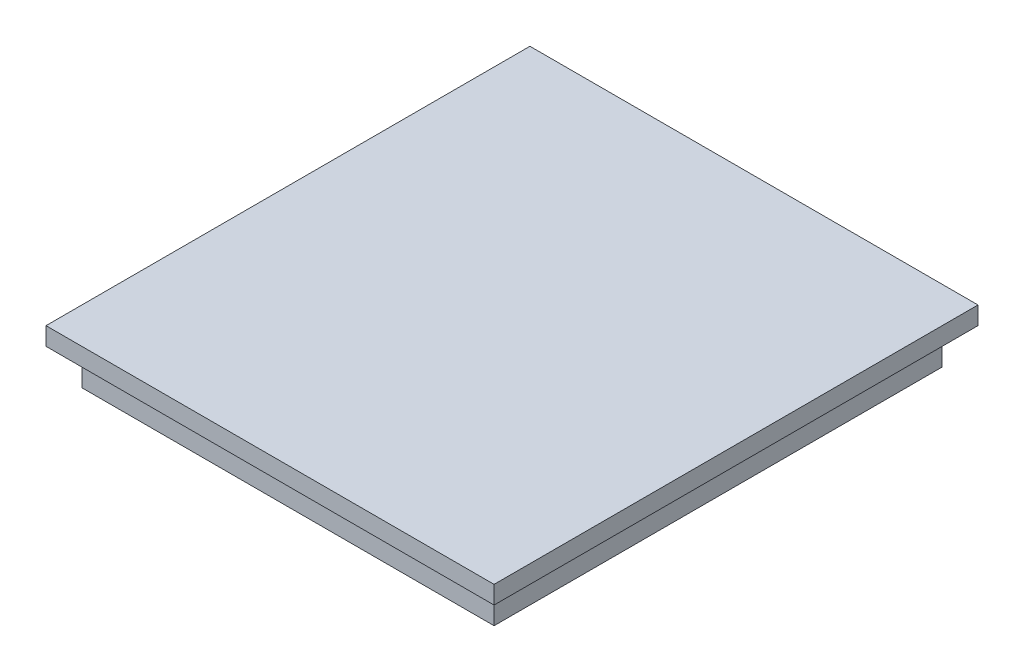
ISO-10303-21;
HEADER;
FILE_DESCRIPTION(('STEP AP214'),'2;1');
FILE_NAME('part.step','',(''),(''),'','','');
FILE_SCHEMA(('AUTOMOTIVE_DESIGN { 1 0 10303 214 1 1 1 1 }'));
ENDSEC;
DATA;
#1=APPLICATION_CONTEXT('core data for automotive mechanical design processes');
#2=APPLICATION_PROTOCOL_DEFINITION('international standard','automotive_design',2000,#1);
#3=PRODUCT_CONTEXT('',#1,'mechanical');
#4=PRODUCT('Part','Part','',(#3));
#5=PRODUCT_RELATED_PRODUCT_CATEGORY('part','',(#4));
#6=PRODUCT_DEFINITION_FORMATION('','',#4);
#7=PRODUCT_DEFINITION_CONTEXT('part definition',#1,'design');
#8=PRODUCT_DEFINITION('design','',#6,#7);
#9=PRODUCT_DEFINITION_SHAPE('','',#8);
#10=(LENGTH_UNIT() NAMED_UNIT(*) SI_UNIT(.MILLI.,.METRE.));
#11=(NAMED_UNIT(*) PLANE_ANGLE_UNIT() SI_UNIT($,.RADIAN.));
#12=(NAMED_UNIT(*) SI_UNIT($,.STERADIAN.) SOLID_ANGLE_UNIT());
#13=UNCERTAINTY_MEASURE_WITH_UNIT(LENGTH_MEASURE(1.E-05),#10,'distance_accuracy_value','');
#14=(GEOMETRIC_REPRESENTATION_CONTEXT(3) GLOBAL_UNCERTAINTY_ASSIGNED_CONTEXT((#13)) GLOBAL_UNIT_ASSIGNED_CONTEXT((#10,
#11,#12)) REPRESENTATION_CONTEXT('',''));
#15=CARTESIAN_POINT('',(0.,0.,0.));
#16=DIRECTION('',(0.,0.,1.));
#17=DIRECTION('',(1.,0.,0.));
#18=AXIS2_PLACEMENT_3D('',#15,#16,#17);
#19=CARTESIAN_POINT('',(57.5,10.,-62.5));
#20=DIRECTION('',(-1.,0.,0.));
#21=DIRECTION('',(0.,0.,1.));
#22=AXIS2_PLACEMENT_3D('',#19,#20,#21);
#23=PLANE('',#22);
#24=DIRECTION('',(0.,0.,-1.));
#25=VECTOR('',#24,1.);
#26=CARTESIAN_POINT('',(57.5,0.,-62.5));
#27=LINE('',#26,#25);
#28=CARTESIAN_POINT('',(57.5,0.,62.5));
#29=VERTEX_POINT('',#28);
#30=CARTESIAN_POINT('',(57.5,0.,-62.5));
#31=VERTEX_POINT('',#30);
#32=EDGE_CURVE('E141',#29,#31,#27,.T.);
#33=ORIENTED_EDGE('',*,*,#32,.T.);
#34=DIRECTION('',(0.,-1.,0.));
#35=VECTOR('',#34,1.);
#36=CARTESIAN_POINT('',(57.5,10.,-62.5));
#37=LINE('',#36,#35);
#38=CARTESIAN_POINT('',(57.5,10.,-62.5));
#39=VERTEX_POINT('',#38);
#40=EDGE_CURVE('E11',#39,#31,#37,.T.);
#41=ORIENTED_EDGE('',*,*,#40,.F.);
#42=DIRECTION('',(0.,0.,-1.));
#43=VECTOR('',#42,1.);
#44=CARTESIAN_POINT('',(57.5,10.,-62.5));
#45=LINE('',#44,#43);
#46=CARTESIAN_POINT('',(57.5,10.,62.5));
#47=VERTEX_POINT('',#46);
#48=EDGE_CURVE('E152',#47,#39,#45,.T.);
#49=ORIENTED_EDGE('',*,*,#48,.F.);
#50=DIRECTION('',(0.,-1.,0.));
#51=VECTOR('',#50,1.);
#52=CARTESIAN_POINT('',(57.5,10.,62.5));
#53=LINE('',#52,#51);
#54=EDGE_CURVE('E165',#47,#29,#53,.T.);
#55=ORIENTED_EDGE('',*,*,#54,.T.);
#56=EDGE_LOOP('',(#33,#41,#49,#55));
#57=FACE_BOUND('',#56,.T.);
#58=ADVANCED_FACE('F39',(#57),#23,.F.);
#59=CARTESIAN_POINT('',(-57.5,10.,-62.5));
#60=DIRECTION('',(0.,0.,1.));
#61=DIRECTION('',(1.,0.,0.));
#62=AXIS2_PLACEMENT_3D('',#59,#60,#61);
#63=PLANE('',#62);
#64=DIRECTION('',(-1.,0.,0.));
#65=VECTOR('',#64,1.);
#66=CARTESIAN_POINT('',(-57.5,0.,-62.5));
#67=LINE('',#66,#65);
#68=CARTESIAN_POINT('',(-57.5,0.,-62.5));
#69=VERTEX_POINT('',#68);
#70=EDGE_CURVE('E146',#31,#69,#67,.T.);
#71=ORIENTED_EDGE('',*,*,#70,.T.);
#72=DIRECTION('',(0.,-1.,0.));
#73=VECTOR('',#72,1.);
#74=CARTESIAN_POINT('',(-57.5,10.,-62.5));
#75=LINE('',#74,#73);
#76=CARTESIAN_POINT('',(-57.5,10.,-62.5));
#77=VERTEX_POINT('',#76);
#78=EDGE_CURVE('E48',#77,#69,#75,.T.);
#79=ORIENTED_EDGE('',*,*,#78,.F.);
#80=DIRECTION('',(-1.,0.,0.));
#81=VECTOR('',#80,1.);
#82=CARTESIAN_POINT('',(-57.5,10.,-62.5));
#83=LINE('',#82,#81);
#84=EDGE_CURVE('E82',#39,#77,#83,.T.);
#85=ORIENTED_EDGE('',*,*,#84,.F.);
#86=ORIENTED_EDGE('',*,*,#40,.T.);
#87=EDGE_LOOP('',(#71,#79,#85,#86));
#88=FACE_BOUND('',#87,.T.);
#89=ADVANCED_FACE('F197',(#88),#63,.F.);
#90=CARTESIAN_POINT('',(-57.5,10.,-62.5));
#91=DIRECTION('',(1.,0.,0.));
#92=DIRECTION('',(0.,0.,-1.));
#93=AXIS2_PLACEMENT_3D('',#90,#91,#92);
#94=PLANE('',#93);
#95=DIRECTION('',(0.,0.,1.));
#96=VECTOR('',#95,1.);
#97=CARTESIAN_POINT('',(-57.5,0.,-62.5));
#98=LINE('',#97,#96);
#99=CARTESIAN_POINT('',(-57.5,0.,62.5));
#100=VERTEX_POINT('',#99);
#101=EDGE_CURVE('E72',#69,#100,#98,.T.);
#102=ORIENTED_EDGE('',*,*,#101,.T.);
#103=DIRECTION('',(0.,-1.,0.));
#104=VECTOR('',#103,1.);
#105=CARTESIAN_POINT('',(-57.5,10.,62.5));
#106=LINE('',#105,#104);
#107=CARTESIAN_POINT('',(-57.5,10.,62.5));
#108=VERTEX_POINT('',#107);
#109=EDGE_CURVE('E56',#108,#100,#106,.T.);
#110=ORIENTED_EDGE('',*,*,#109,.F.);
#111=DIRECTION('',(0.,0.,1.));
#112=VECTOR('',#111,1.);
#113=CARTESIAN_POINT('',(-57.5,10.,-62.5));
#114=LINE('',#113,#112);
#115=EDGE_CURVE('E158',#77,#108,#114,.T.);
#116=ORIENTED_EDGE('',*,*,#115,.F.);
#117=ORIENTED_EDGE('',*,*,#78,.T.);
#118=EDGE_LOOP('',(#102,#110,#116,#117));
#119=FACE_BOUND('',#118,.T.);
#120=ADVANCED_FACE('F177',(#119),#94,.F.);
#121=CARTESIAN_POINT('',(-57.5,10.,62.5));
#122=DIRECTION('',(0.,0.,-1.));
#123=DIRECTION('',(-1.,0.,0.));
#124=AXIS2_PLACEMENT_3D('',#121,#122,#123);
#125=PLANE('',#124);
#126=DIRECTION('',(1.,0.,0.));
#127=VECTOR('',#126,1.);
#128=CARTESIAN_POINT('',(-57.5,0.,62.5));
#129=LINE('',#128,#127);
#130=EDGE_CURVE('E77',#100,#29,#129,.T.);
#131=ORIENTED_EDGE('',*,*,#130,.T.);
#132=ORIENTED_EDGE('',*,*,#54,.F.);
#133=DIRECTION('',(1.,0.,0.));
#134=VECTOR('',#133,1.);
#135=CARTESIAN_POINT('',(-57.5,10.,62.5));
#136=LINE('',#135,#134);
#137=EDGE_CURVE('E162',#108,#47,#136,.T.);
#138=ORIENTED_EDGE('',*,*,#137,.F.);
#139=ORIENTED_EDGE('',*,*,#109,.T.);
#140=EDGE_LOOP('',(#131,#132,#138,#139));
#141=FACE_BOUND('',#140,.T.);
#142=ADVANCED_FACE('F182',(#141),#125,.F.);
#143=CARTESIAN_POINT('',(0.,0.,0.));
#144=DIRECTION('',(0.,1.,0.));
#145=DIRECTION('',(0.,0.,1.));
#146=AXIS2_PLACEMENT_3D('',#143,#144,#145);
#147=PLANE('',#146);
#148=ORIENTED_EDGE('',*,*,#32,.F.);
#149=ORIENTED_EDGE('',*,*,#130,.F.);
#150=ORIENTED_EDGE('',*,*,#101,.F.);
#151=ORIENTED_EDGE('',*,*,#70,.F.);
#152=EDGE_LOOP('',(#148,#149,#150,#151));
#153=FACE_BOUND('',#152,.T.);
#154=ADVANCED_FACE('F180',(#153),#147,.F.);
#155=CARTESIAN_POINT('',(0.,10.,0.));
#156=DIRECTION('',(0.,1.,0.));
#157=DIRECTION('',(0.,0.,1.));
#158=AXIS2_PLACEMENT_3D('',#155,#156,#157);
#159=PLANE('',#158);
#160=DIRECTION('',(0.,0.,-1.));
#161=VECTOR('',#160,1.);
#162=CARTESIAN_POINT('',(62.5,10.,-67.5));
#163=LINE('',#162,#161);
#164=CARTESIAN_POINT('',(62.5,10.,67.5));
#165=VERTEX_POINT('',#164);
#166=CARTESIAN_POINT('',(62.5,10.,-67.5));
#167=VERTEX_POINT('',#166);
#168=EDGE_CURVE('E139',#165,#167,#163,.T.);
#169=ORIENTED_EDGE('',*,*,#168,.F.);
#170=DIRECTION('',(1.,0.,0.));
#171=VECTOR('',#170,1.);
#172=CARTESIAN_POINT('',(-62.5,10.,67.5));
#173=LINE('',#172,#171);
#174=CARTESIAN_POINT('',(-62.5,10.,67.5));
#175=VERTEX_POINT('',#174);
#176=EDGE_CURVE('E135',#175,#165,#173,.T.);
#177=ORIENTED_EDGE('',*,*,#176,.F.);
#178=DIRECTION('',(0.,0.,1.));
#179=VECTOR('',#178,1.);
#180=CARTESIAN_POINT('',(-62.5,10.,-67.5));
#181=LINE('',#180,#179);
#182=CARTESIAN_POINT('',(-62.5,10.,-67.5));
#183=VERTEX_POINT('',#182);
#184=EDGE_CURVE('E225',#183,#175,#181,.T.);
#185=ORIENTED_EDGE('',*,*,#184,.F.);
#186=DIRECTION('',(-1.,0.,0.));
#187=VECTOR('',#186,1.);
#188=CARTESIAN_POINT('',(-62.5,10.,-67.5));
#189=LINE('',#188,#187);
#190=EDGE_CURVE('E229',#167,#183,#189,.T.);
#191=ORIENTED_EDGE('',*,*,#190,.F.);
#192=EDGE_LOOP('',(#169,#177,#185,#191));
#193=FACE_BOUND('',#192,.T.);
#194=ORIENTED_EDGE('',*,*,#137,.T.);
#195=ORIENTED_EDGE('',*,*,#48,.T.);
#196=ORIENTED_EDGE('',*,*,#84,.T.);
#197=ORIENTED_EDGE('',*,*,#115,.T.);
#198=EDGE_LOOP('',(#194,#195,#196,#197));
#199=FACE_BOUND('',#198,.T.);
#200=ADVANCED_FACE('F184',(#193,#199),#159,.F.);
#201=CARTESIAN_POINT('',(62.5,15.,-67.5));
#202=DIRECTION('',(-1.,0.,0.));
#203=DIRECTION('',(0.,0.,1.));
#204=AXIS2_PLACEMENT_3D('',#201,#202,#203);
#205=PLANE('',#204);
#206=ORIENTED_EDGE('',*,*,#168,.T.);
#207=DIRECTION('',(0.,-1.,0.));
#208=VECTOR('',#207,1.);
#209=CARTESIAN_POINT('',(62.5,15.,-67.5));
#210=LINE('',#209,#208);
#211=CARTESIAN_POINT('',(62.5,15.,-67.5));
#212=VERTEX_POINT('',#211);
#213=EDGE_CURVE('E117',#212,#167,#210,.T.);
#214=ORIENTED_EDGE('',*,*,#213,.F.);
#215=DIRECTION('',(0.,0.,-1.));
#216=VECTOR('',#215,1.);
#217=CARTESIAN_POINT('',(62.5,15.,-67.5));
#218=LINE('',#217,#216);
#219=CARTESIAN_POINT('',(62.5,15.,67.5));
#220=VERTEX_POINT('',#219);
#221=EDGE_CURVE('E125',#220,#212,#218,.T.);
#222=ORIENTED_EDGE('',*,*,#221,.F.);
#223=DIRECTION('',(0.,-1.,0.));
#224=VECTOR('',#223,1.);
#225=CARTESIAN_POINT('',(62.5,15.,67.5));
#226=LINE('',#225,#224);
#227=EDGE_CURVE('E221',#220,#165,#226,.T.);
#228=ORIENTED_EDGE('',*,*,#227,.T.);
#229=EDGE_LOOP('',(#206,#214,#222,#228));
#230=FACE_BOUND('',#229,.T.);
#231=ADVANCED_FACE('F137',(#230),#205,.F.);
#232=CARTESIAN_POINT('',(-62.5,15.,-67.5));
#233=DIRECTION('',(0.,0.,1.));
#234=DIRECTION('',(1.,0.,0.));
#235=AXIS2_PLACEMENT_3D('',#232,#233,#234);
#236=PLANE('',#235);
#237=ORIENTED_EDGE('',*,*,#190,.T.);
#238=DIRECTION('',(0.,-1.,0.));
#239=VECTOR('',#238,1.);
#240=CARTESIAN_POINT('',(-62.5,15.,-67.5));
#241=LINE('',#240,#239);
#242=CARTESIAN_POINT('',(-62.5,15.,-67.5));
#243=VERTEX_POINT('',#242);
#244=EDGE_CURVE('E120',#243,#183,#241,.T.);
#245=ORIENTED_EDGE('',*,*,#244,.F.);
#246=DIRECTION('',(-1.,0.,0.));
#247=VECTOR('',#246,1.);
#248=CARTESIAN_POINT('',(-62.5,15.,-67.5));
#249=LINE('',#248,#247);
#250=EDGE_CURVE('E113',#212,#243,#249,.T.);
#251=ORIENTED_EDGE('',*,*,#250,.F.);
#252=ORIENTED_EDGE('',*,*,#213,.T.);
#253=EDGE_LOOP('',(#237,#245,#251,#252));
#254=FACE_BOUND('',#253,.T.);
#255=ADVANCED_FACE('F115',(#254),#236,.F.);
#256=CARTESIAN_POINT('',(-62.5,15.,-67.5));
#257=DIRECTION('',(1.,0.,0.));
#258=DIRECTION('',(0.,0.,-1.));
#259=AXIS2_PLACEMENT_3D('',#256,#257,#258);
#260=PLANE('',#259);
#261=ORIENTED_EDGE('',*,*,#184,.T.);
#262=DIRECTION('',(0.,-1.,0.));
#263=VECTOR('',#262,1.);
#264=CARTESIAN_POINT('',(-62.5,15.,67.5));
#265=LINE('',#264,#263);
#266=CARTESIAN_POINT('',(-62.5,15.,67.5));
#267=VERTEX_POINT('',#266);
#268=EDGE_CURVE('E148',#267,#175,#265,.T.);
#269=ORIENTED_EDGE('',*,*,#268,.F.);
#270=DIRECTION('',(0.,0.,1.));
#271=VECTOR('',#270,1.);
#272=CARTESIAN_POINT('',(-62.5,15.,-67.5));
#273=LINE('',#272,#271);
#274=EDGE_CURVE('E124',#243,#267,#273,.T.);
#275=ORIENTED_EDGE('',*,*,#274,.F.);
#276=ORIENTED_EDGE('',*,*,#244,.T.);
#277=EDGE_LOOP('',(#261,#269,#275,#276));
#278=FACE_BOUND('',#277,.T.);
#279=ADVANCED_FACE('F210',(#278),#260,.F.);
#280=CARTESIAN_POINT('',(-62.5,15.,67.5));
#281=DIRECTION('',(0.,0.,-1.));
#282=DIRECTION('',(-1.,0.,0.));
#283=AXIS2_PLACEMENT_3D('',#280,#281,#282);
#284=PLANE('',#283);
#285=ORIENTED_EDGE('',*,*,#176,.T.);
#286=ORIENTED_EDGE('',*,*,#227,.F.);
#287=DIRECTION('',(1.,0.,0.));
#288=VECTOR('',#287,1.);
#289=CARTESIAN_POINT('',(-62.5,15.,67.5));
#290=LINE('',#289,#288);
#291=EDGE_CURVE('E130',#267,#220,#290,.T.);
#292=ORIENTED_EDGE('',*,*,#291,.F.);
#293=ORIENTED_EDGE('',*,*,#268,.T.);
#294=EDGE_LOOP('',(#285,#286,#292,#293));
#295=FACE_BOUND('',#294,.T.);
#296=ADVANCED_FACE('F212',(#295),#284,.F.);
#297=CARTESIAN_POINT('',(0.,15.,0.));
#298=DIRECTION('',(0.,1.,0.));
#299=DIRECTION('',(0.,0.,1.));
#300=AXIS2_PLACEMENT_3D('',#297,#298,#299);
#301=PLANE('',#300);
#302=ORIENTED_EDGE('',*,*,#221,.T.);
#303=ORIENTED_EDGE('',*,*,#250,.T.);
#304=ORIENTED_EDGE('',*,*,#274,.T.);
#305=ORIENTED_EDGE('',*,*,#291,.T.);
#306=EDGE_LOOP('',(#302,#303,#304,#305));
#307=FACE_BOUND('',#306,.T.);
#308=ADVANCED_FACE('F128',(#307),#301,.T.);
#309=CLOSED_SHELL('',(#58,#89,#120,#142,#154,#200,#231,#255,#279,#296,#308));
#310=MANIFOLD_SOLID_BREP('B2',#309);
#311=ADVANCED_BREP_SHAPE_REPRESENTATION('',(#18,#310),#14);
#312=SHAPE_DEFINITION_REPRESENTATION(#9,#311);
ENDSEC;
END-ISO-10303-21;
